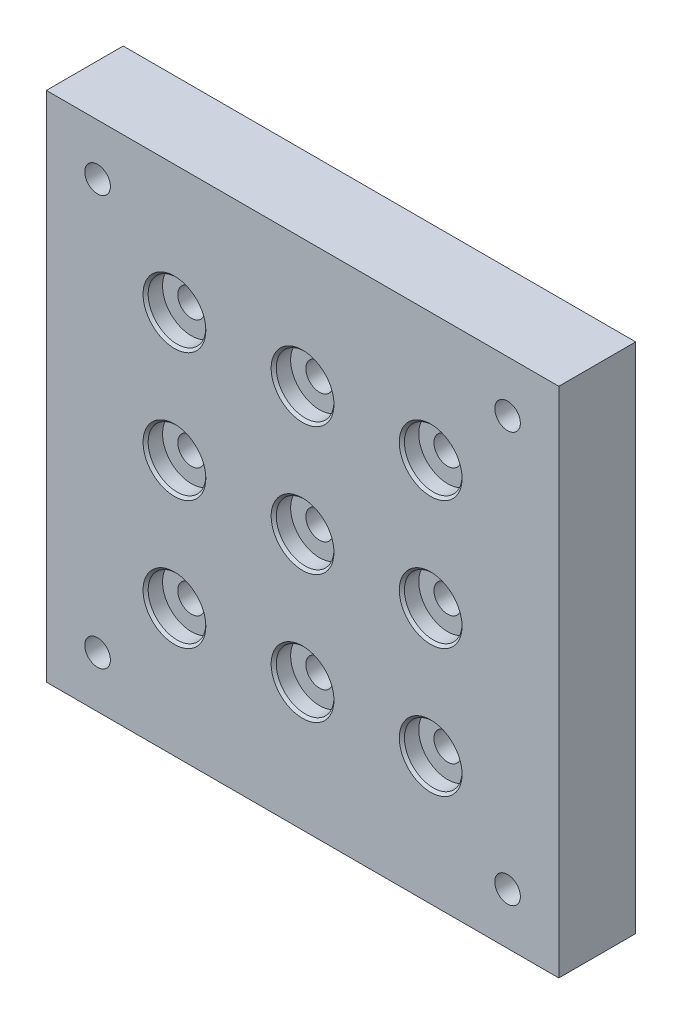
ISO-10303-21;
HEADER;
FILE_DESCRIPTION(('STEP AP214'),'2;1');
FILE_NAME('part.step','',(''),(''),'','','');
FILE_SCHEMA(('AUTOMOTIVE_DESIGN { 1 0 10303 214 1 1 1 1 }'));
ENDSEC;
DATA;
#1=APPLICATION_CONTEXT('core data for automotive mechanical design processes');
#2=APPLICATION_PROTOCOL_DEFINITION('international standard','automotive_design',2000,#1);
#3=PRODUCT_CONTEXT('',#1,'mechanical');
#4=PRODUCT('Part','Part','',(#3));
#5=PRODUCT_RELATED_PRODUCT_CATEGORY('part','',(#4));
#6=PRODUCT_DEFINITION_FORMATION('','',#4);
#7=PRODUCT_DEFINITION_CONTEXT('part definition',#1,'design');
#8=PRODUCT_DEFINITION('design','',#6,#7);
#9=PRODUCT_DEFINITION_SHAPE('','',#8);
#10=(LENGTH_UNIT() NAMED_UNIT(*) SI_UNIT(.MILLI.,.METRE.));
#11=(NAMED_UNIT(*) PLANE_ANGLE_UNIT() SI_UNIT($,.RADIAN.));
#12=(NAMED_UNIT(*) SI_UNIT($,.STERADIAN.) SOLID_ANGLE_UNIT());
#13=UNCERTAINTY_MEASURE_WITH_UNIT(LENGTH_MEASURE(1.E-05),#10,'distance_accuracy_value','');
#14=(GEOMETRIC_REPRESENTATION_CONTEXT(3) GLOBAL_UNCERTAINTY_ASSIGNED_CONTEXT((#13)) GLOBAL_UNIT_ASSIGNED_CONTEXT((#10,
#11,#12)) REPRESENTATION_CONTEXT('',''));
#15=CARTESIAN_POINT('',(0.,0.,0.));
#16=DIRECTION('',(0.,0.,1.));
#17=DIRECTION('',(1.,0.,0.));
#18=AXIS2_PLACEMENT_3D('',#15,#16,#17);
#19=CARTESIAN_POINT('',(0.,0.,19.05));
#20=DIRECTION('',(0.,0.,-1.));
#21=DIRECTION('',(-1.,0.,0.));
#22=AXIS2_PLACEMENT_3D('',#19,#20,#21);
#23=PLANE('',#22);
#24=CARTESIAN_POINT('',(-50.8,50.8,19.05));
#25=DIRECTION('',(0.,0.,1.));
#26=DIRECTION('',(1.,0.,0.));
#27=AXIS2_PLACEMENT_3D('',#24,#25,#26);
#28=CIRCLE('',#27,3.17499999999999);
#29=CARTESIAN_POINT('',(-47.625,50.8,19.05));
#30=VERTEX_POINT('',#29);
#31=EDGE_CURVE('E265',#30,#30,#28,.T.);
#32=ORIENTED_EDGE('',*,*,#31,.F.);
#33=EDGE_LOOP('',(#32));
#34=FACE_BOUND('',#33,.T.);
#35=CARTESIAN_POINT('',(50.8,50.8,19.05));
#36=DIRECTION('',(0.,0.,1.));
#37=DIRECTION('',(1.,0.,0.));
#38=AXIS2_PLACEMENT_3D('',#35,#36,#37);
#39=CIRCLE('',#38,3.17499999999999);
#40=CARTESIAN_POINT('',(53.975,50.8,19.05));
#41=VERTEX_POINT('',#40);
#42=EDGE_CURVE('E259',#41,#41,#39,.T.);
#43=ORIENTED_EDGE('',*,*,#42,.F.);
#44=EDGE_LOOP('',(#43));
#45=FACE_BOUND('',#44,.T.);
#46=CARTESIAN_POINT('',(50.8,-50.8,19.05));
#47=DIRECTION('',(0.,0.,1.));
#48=DIRECTION('',(1.,0.,0.));
#49=AXIS2_PLACEMENT_3D('',#46,#47,#48);
#50=CIRCLE('',#49,3.17499999999999);
#51=CARTESIAN_POINT('',(53.975,-50.8,19.05));
#52=VERTEX_POINT('',#51);
#53=EDGE_CURVE('E253',#52,#52,#50,.T.);
#54=ORIENTED_EDGE('',*,*,#53,.F.);
#55=EDGE_LOOP('',(#54));
#56=FACE_BOUND('',#55,.T.);
#57=DIRECTION('',(0.,1.,0.));
#58=VECTOR('',#57,1.);
#59=CARTESIAN_POINT('',(63.5,-63.5,19.05));
#60=LINE('',#59,#58);
#61=CARTESIAN_POINT('',(63.5,-63.5,19.05));
#62=VERTEX_POINT('',#61);
#63=CARTESIAN_POINT('',(63.5,63.5,19.05));
#64=VERTEX_POINT('',#63);
#65=EDGE_CURVE('E86',#62,#64,#60,.T.);
#66=ORIENTED_EDGE('',*,*,#65,.T.);
#67=DIRECTION('',(-1.,0.,0.));
#68=VECTOR('',#67,1.);
#69=CARTESIAN_POINT('',(-63.5,63.5,19.05));
#70=LINE('',#69,#68);
#71=CARTESIAN_POINT('',(-63.5,63.5,19.05));
#72=VERTEX_POINT('',#71);
#73=EDGE_CURVE('E81',#64,#72,#70,.T.);
#74=ORIENTED_EDGE('',*,*,#73,.T.);
#75=DIRECTION('',(0.,-1.,0.));
#76=VECTOR('',#75,1.);
#77=CARTESIAN_POINT('',(-63.5,-63.5,19.05));
#78=LINE('',#77,#76);
#79=CARTESIAN_POINT('',(-63.5,-63.5,19.05));
#80=VERTEX_POINT('',#79);
#81=EDGE_CURVE('E84',#72,#80,#78,.T.);
#82=ORIENTED_EDGE('',*,*,#81,.T.);
#83=DIRECTION('',(1.,0.,0.));
#84=VECTOR('',#83,1.);
#85=CARTESIAN_POINT('',(-63.5,-63.5,19.05));
#86=LINE('',#85,#84);
#87=EDGE_CURVE('E51',#80,#62,#86,.T.);
#88=ORIENTED_EDGE('',*,*,#87,.T.);
#89=EDGE_LOOP('',(#66,#74,#82,#88));
#90=FACE_BOUND('',#89,.T.);
#91=CARTESIAN_POINT('',(0.,0.,19.05));
#92=DIRECTION('',(0.,0.,1.));
#93=DIRECTION('',(1.,0.,0.));
#94=AXIS2_PLACEMENT_3D('',#91,#92,#93);
#95=CIRCLE('',#94,7.77875);
#96=CARTESIAN_POINT('',(7.77875,0.,19.05));
#97=VERTEX_POINT('',#96);
#98=EDGE_CURVE('E124',#97,#97,#95,.T.);
#99=ORIENTED_EDGE('',*,*,#98,.F.);
#100=EDGE_LOOP('',(#99));
#101=FACE_BOUND('',#100,.T.);
#102=CARTESIAN_POINT('',(-31.75,0.,19.05));
#103=DIRECTION('',(0.,0.,1.));
#104=DIRECTION('',(1.,0.,0.));
#105=AXIS2_PLACEMENT_3D('',#102,#103,#104);
#106=CIRCLE('',#105,7.77875);
#107=CARTESIAN_POINT('',(-23.97125,0.,19.05));
#108=VERTEX_POINT('',#107);
#109=EDGE_CURVE('E139',#108,#108,#106,.T.);
#110=ORIENTED_EDGE('',*,*,#109,.F.);
#111=EDGE_LOOP('',(#110));
#112=FACE_BOUND('',#111,.T.);
#113=CARTESIAN_POINT('',(31.75,0.,19.05));
#114=DIRECTION('',(0.,0.,1.));
#115=DIRECTION('',(1.,0.,0.));
#116=AXIS2_PLACEMENT_3D('',#113,#114,#115);
#117=CIRCLE('',#116,7.77875);
#118=CARTESIAN_POINT('',(39.52875,0.,19.05));
#119=VERTEX_POINT('',#118);
#120=EDGE_CURVE('E154',#119,#119,#117,.T.);
#121=ORIENTED_EDGE('',*,*,#120,.F.);
#122=EDGE_LOOP('',(#121));
#123=FACE_BOUND('',#122,.T.);
#124=CARTESIAN_POINT('',(0.,31.75,19.05));
#125=DIRECTION('',(0.,0.,1.));
#126=DIRECTION('',(1.,0.,0.));
#127=AXIS2_PLACEMENT_3D('',#124,#125,#126);
#128=CIRCLE('',#127,7.77875);
#129=CARTESIAN_POINT('',(7.77875,31.75,19.05));
#130=VERTEX_POINT('',#129);
#131=EDGE_CURVE('E169',#130,#130,#128,.T.);
#132=ORIENTED_EDGE('',*,*,#131,.F.);
#133=EDGE_LOOP('',(#132));
#134=FACE_BOUND('',#133,.T.);
#135=CARTESIAN_POINT('',(-31.75,31.75,19.05));
#136=DIRECTION('',(0.,0.,1.));
#137=DIRECTION('',(1.,0.,0.));
#138=AXIS2_PLACEMENT_3D('',#135,#136,#137);
#139=CIRCLE('',#138,7.77875);
#140=CARTESIAN_POINT('',(-23.97125,31.75,19.05));
#141=VERTEX_POINT('',#140);
#142=EDGE_CURVE('E184',#141,#141,#139,.T.);
#143=ORIENTED_EDGE('',*,*,#142,.F.);
#144=EDGE_LOOP('',(#143));
#145=FACE_BOUND('',#144,.T.);
#146=CARTESIAN_POINT('',(31.75,31.75,19.05));
#147=DIRECTION('',(0.,0.,1.));
#148=DIRECTION('',(1.,0.,0.));
#149=AXIS2_PLACEMENT_3D('',#146,#147,#148);
#150=CIRCLE('',#149,7.77875);
#151=CARTESIAN_POINT('',(39.52875,31.75,19.05));
#152=VERTEX_POINT('',#151);
#153=EDGE_CURVE('E199',#152,#152,#150,.T.);
#154=ORIENTED_EDGE('',*,*,#153,.F.);
#155=EDGE_LOOP('',(#154));
#156=FACE_BOUND('',#155,.T.);
#157=CARTESIAN_POINT('',(0.,-31.75,19.05));
#158=DIRECTION('',(0.,0.,1.));
#159=DIRECTION('',(1.,0.,0.));
#160=AXIS2_PLACEMENT_3D('',#157,#158,#159);
#161=CIRCLE('',#160,7.77875);
#162=CARTESIAN_POINT('',(7.77875,-31.75,19.05));
#163=VERTEX_POINT('',#162);
#164=EDGE_CURVE('E214',#163,#163,#161,.T.);
#165=ORIENTED_EDGE('',*,*,#164,.F.);
#166=EDGE_LOOP('',(#165));
#167=FACE_BOUND('',#166,.T.);
#168=CARTESIAN_POINT('',(-31.75,-31.75,19.05));
#169=DIRECTION('',(0.,0.,1.));
#170=DIRECTION('',(1.,0.,0.));
#171=AXIS2_PLACEMENT_3D('',#168,#169,#170);
#172=CIRCLE('',#171,7.77875);
#173=CARTESIAN_POINT('',(-23.97125,-31.75,19.05));
#174=VERTEX_POINT('',#173);
#175=EDGE_CURVE('E229',#174,#174,#172,.T.);
#176=ORIENTED_EDGE('',*,*,#175,.F.);
#177=EDGE_LOOP('',(#176));
#178=FACE_BOUND('',#177,.T.);
#179=CARTESIAN_POINT('',(31.75,-31.75,19.05));
#180=DIRECTION('',(0.,0.,1.));
#181=DIRECTION('',(1.,0.,0.));
#182=AXIS2_PLACEMENT_3D('',#179,#180,#181);
#183=CIRCLE('',#182,7.77875);
#184=CARTESIAN_POINT('',(39.52875,-31.75,19.05));
#185=VERTEX_POINT('',#184);
#186=EDGE_CURVE('E244',#185,#185,#183,.T.);
#187=ORIENTED_EDGE('',*,*,#186,.F.);
#188=EDGE_LOOP('',(#187));
#189=FACE_BOUND('',#188,.T.);
#190=CARTESIAN_POINT('',(-50.8,-50.8,19.05));
#191=DIRECTION('',(0.,0.,1.));
#192=DIRECTION('',(1.,0.,0.));
#193=AXIS2_PLACEMENT_3D('',#190,#191,#192);
#194=CIRCLE('',#193,3.17499999999999);
#195=CARTESIAN_POINT('',(-47.625,-50.8,19.05));
#196=VERTEX_POINT('',#195);
#197=EDGE_CURVE('E250',#196,#196,#194,.T.);
#198=ORIENTED_EDGE('',*,*,#197,.F.);
#199=EDGE_LOOP('',(#198));
#200=FACE_BOUND('',#199,.T.);
#201=ADVANCED_FACE('F33',(#34,#45,#56,#90,#101,#112,#123,#134,#145,#156,#167,#178,#189,#200),
#23,.F.);
#202=CARTESIAN_POINT('',(63.5,-63.5,19.05));
#203=DIRECTION('',(-1.,0.,0.));
#204=DIRECTION('',(0.,0.,1.));
#205=AXIS2_PLACEMENT_3D('',#202,#203,#204);
#206=PLANE('',#205);
#207=DIRECTION('',(0.,1.,0.));
#208=VECTOR('',#207,1.);
#209=CARTESIAN_POINT('',(63.5,-63.5,0.));
#210=LINE('',#209,#208);
#211=CARTESIAN_POINT('',(63.5,-63.5,0.));
#212=VERTEX_POINT('',#211);
#213=CARTESIAN_POINT('',(63.5,63.5,0.));
#214=VERTEX_POINT('',#213);
#215=EDGE_CURVE('E99',#212,#214,#210,.T.);
#216=ORIENTED_EDGE('',*,*,#215,.T.);
#217=DIRECTION('',(0.,0.,-1.));
#218=VECTOR('',#217,1.);
#219=CARTESIAN_POINT('',(63.5,63.5,19.05));
#220=LINE('',#219,#218);
#221=EDGE_CURVE('E11',#64,#214,#220,.T.);
#222=ORIENTED_EDGE('',*,*,#221,.F.);
#223=ORIENTED_EDGE('',*,*,#65,.F.);
#224=DIRECTION('',(0.,0.,-1.));
#225=VECTOR('',#224,1.);
#226=CARTESIAN_POINT('',(63.5,-63.5,19.05));
#227=LINE('',#226,#225);
#228=EDGE_CURVE('E95',#62,#212,#227,.T.);
#229=ORIENTED_EDGE('',*,*,#228,.T.);
#230=EDGE_LOOP('',(#216,#222,#223,#229));
#231=FACE_BOUND('',#230,.T.);
#232=ADVANCED_FACE('F35',(#231),#206,.F.);
#233=CARTESIAN_POINT('',(-63.5,63.5,19.05));
#234=DIRECTION('',(0.,-1.,0.));
#235=DIRECTION('',(0.,0.,-1.));
#236=AXIS2_PLACEMENT_3D('',#233,#234,#235);
#237=PLANE('',#236);
#238=DIRECTION('',(-1.,0.,0.));
#239=VECTOR('',#238,1.);
#240=CARTESIAN_POINT('',(-63.5,63.5,0.));
#241=LINE('',#240,#239);
#242=CARTESIAN_POINT('',(-63.5,63.5,0.));
#243=VERTEX_POINT('',#242);
#244=EDGE_CURVE('E90',#214,#243,#241,.T.);
#245=ORIENTED_EDGE('',*,*,#244,.T.);
#246=DIRECTION('',(0.,0.,-1.));
#247=VECTOR('',#246,1.);
#248=CARTESIAN_POINT('',(-63.5,63.5,19.05));
#249=LINE('',#248,#247);
#250=EDGE_CURVE('E43',#72,#243,#249,.T.);
#251=ORIENTED_EDGE('',*,*,#250,.F.);
#252=ORIENTED_EDGE('',*,*,#73,.F.);
#253=ORIENTED_EDGE('',*,*,#221,.T.);
#254=EDGE_LOOP('',(#245,#251,#252,#253));
#255=FACE_BOUND('',#254,.T.);
#256=ADVANCED_FACE('F89',(#255),#237,.F.);
#257=CARTESIAN_POINT('',(-63.5,-63.5,19.05));
#258=DIRECTION('',(1.,0.,0.));
#259=DIRECTION('',(0.,0.,-1.));
#260=AXIS2_PLACEMENT_3D('',#257,#258,#259);
#261=PLANE('',#260);
#262=DIRECTION('',(0.,-1.,0.));
#263=VECTOR('',#262,1.);
#264=CARTESIAN_POINT('',(-63.5,-63.5,0.));
#265=LINE('',#264,#263);
#266=CARTESIAN_POINT('',(-63.5,-63.5,0.));
#267=VERTEX_POINT('',#266);
#268=EDGE_CURVE('E68',#243,#267,#265,.T.);
#269=ORIENTED_EDGE('',*,*,#268,.T.);
#270=DIRECTION('',(0.,0.,-1.));
#271=VECTOR('',#270,1.);
#272=CARTESIAN_POINT('',(-63.5,-63.5,19.05));
#273=LINE('',#272,#271);
#274=EDGE_CURVE('E91',#80,#267,#273,.T.);
#275=ORIENTED_EDGE('',*,*,#274,.F.);
#276=ORIENTED_EDGE('',*,*,#81,.F.);
#277=ORIENTED_EDGE('',*,*,#250,.T.);
#278=EDGE_LOOP('',(#269,#275,#276,#277));
#279=FACE_BOUND('',#278,.T.);
#280=ADVANCED_FACE('F93',(#279),#261,.F.);
#281=CARTESIAN_POINT('',(-63.5,-63.5,19.05));
#282=DIRECTION('',(0.,1.,0.));
#283=DIRECTION('',(0.,0.,1.));
#284=AXIS2_PLACEMENT_3D('',#281,#282,#283);
#285=PLANE('',#284);
#286=DIRECTION('',(1.,0.,0.));
#287=VECTOR('',#286,1.);
#288=CARTESIAN_POINT('',(-63.5,-63.5,0.));
#289=LINE('',#288,#287);
#290=EDGE_CURVE('E74',#267,#212,#289,.T.);
#291=ORIENTED_EDGE('',*,*,#290,.T.);
#292=ORIENTED_EDGE('',*,*,#228,.F.);
#293=ORIENTED_EDGE('',*,*,#87,.F.);
#294=ORIENTED_EDGE('',*,*,#274,.T.);
#295=EDGE_LOOP('',(#291,#292,#293,#294));
#296=FACE_BOUND('',#295,.T.);
#297=ADVANCED_FACE('F107',(#296),#285,.F.);
#298=CARTESIAN_POINT('',(0.,0.,0.));
#299=DIRECTION('',(0.,0.,-1.));
#300=DIRECTION('',(-1.,0.,0.));
#301=AXIS2_PLACEMENT_3D('',#298,#299,#300);
#302=PLANE('',#301);
#303=CARTESIAN_POINT('',(-50.8,50.8,0.));
#304=DIRECTION('',(0.,0.,-1.));
#305=DIRECTION('',(-1.,0.,0.));
#306=AXIS2_PLACEMENT_3D('',#303,#304,#305);
#307=CIRCLE('',#306,3.17499999999999);
#308=CARTESIAN_POINT('',(-53.975,50.8,0.));
#309=VERTEX_POINT('',#308);
#310=EDGE_CURVE('E262',#309,#309,#307,.T.);
#311=ORIENTED_EDGE('',*,*,#310,.F.);
#312=EDGE_LOOP('',(#311));
#313=FACE_BOUND('',#312,.T.);
#314=CARTESIAN_POINT('',(50.8,50.8,0.));
#315=DIRECTION('',(0.,0.,-1.));
#316=DIRECTION('',(-1.,0.,0.));
#317=AXIS2_PLACEMENT_3D('',#314,#315,#316);
#318=CIRCLE('',#317,3.17499999999999);
#319=CARTESIAN_POINT('',(47.625,50.8,0.));
#320=VERTEX_POINT('',#319);
#321=EDGE_CURVE('E256',#320,#320,#318,.T.);
#322=ORIENTED_EDGE('',*,*,#321,.F.);
#323=EDGE_LOOP('',(#322));
#324=FACE_BOUND('',#323,.T.);
#325=CARTESIAN_POINT('',(50.8,-50.8,0.));
#326=DIRECTION('',(0.,0.,-1.));
#327=DIRECTION('',(-1.,0.,0.));
#328=AXIS2_PLACEMENT_3D('',#325,#326,#327);
#329=CIRCLE('',#328,3.17499999999999);
#330=CARTESIAN_POINT('',(47.625,-50.8,0.));
#331=VERTEX_POINT('',#330);
#332=EDGE_CURVE('E37',#331,#331,#329,.T.);
#333=ORIENTED_EDGE('',*,*,#332,.F.);
#334=EDGE_LOOP('',(#333));
#335=FACE_BOUND('',#334,.T.);
#336=CARTESIAN_POINT('',(-50.8,-50.8,0.));
#337=DIRECTION('',(0.,0.,-1.));
#338=DIRECTION('',(-1.,0.,0.));
#339=AXIS2_PLACEMENT_3D('',#336,#337,#338);
#340=CIRCLE('',#339,3.17499999999999);
#341=CARTESIAN_POINT('',(-53.975,-50.8,0.));
#342=VERTEX_POINT('',#341);
#343=EDGE_CURVE('E247',#342,#342,#340,.T.);
#344=ORIENTED_EDGE('',*,*,#343,.F.);
#345=EDGE_LOOP('',(#344));
#346=FACE_BOUND('',#345,.T.);
#347=CARTESIAN_POINT('',(31.75,-31.75,0.));
#348=DIRECTION('',(0.,0.,1.));
#349=DIRECTION('',(1.,0.,0.));
#350=AXIS2_PLACEMENT_3D('',#347,#348,#349);
#351=CIRCLE('',#350,3.3782);
#352=CARTESIAN_POINT('',(35.1282,-31.75,0.));
#353=VERTEX_POINT('',#352);
#354=EDGE_CURVE('E232',#353,#353,#351,.T.);
#355=ORIENTED_EDGE('',*,*,#354,.T.);
#356=EDGE_LOOP('',(#355));
#357=FACE_BOUND('',#356,.T.);
#358=CARTESIAN_POINT('',(-31.75,-31.75,0.));
#359=DIRECTION('',(0.,0.,1.));
#360=DIRECTION('',(1.,0.,0.));
#361=AXIS2_PLACEMENT_3D('',#358,#359,#360);
#362=CIRCLE('',#361,3.3782);
#363=CARTESIAN_POINT('',(-28.3718,-31.75,0.));
#364=VERTEX_POINT('',#363);
#365=EDGE_CURVE('E217',#364,#364,#362,.T.);
#366=ORIENTED_EDGE('',*,*,#365,.T.);
#367=EDGE_LOOP('',(#366));
#368=FACE_BOUND('',#367,.T.);
#369=CARTESIAN_POINT('',(0.,-31.75,0.));
#370=DIRECTION('',(0.,0.,1.));
#371=DIRECTION('',(1.,0.,0.));
#372=AXIS2_PLACEMENT_3D('',#369,#370,#371);
#373=CIRCLE('',#372,3.3782);
#374=CARTESIAN_POINT('',(3.3782,-31.75,0.));
#375=VERTEX_POINT('',#374);
#376=EDGE_CURVE('E202',#375,#375,#373,.T.);
#377=ORIENTED_EDGE('',*,*,#376,.T.);
#378=EDGE_LOOP('',(#377));
#379=FACE_BOUND('',#378,.T.);
#380=CARTESIAN_POINT('',(31.75,31.75,0.));
#381=DIRECTION('',(0.,0.,1.));
#382=DIRECTION('',(1.,0.,0.));
#383=AXIS2_PLACEMENT_3D('',#380,#381,#382);
#384=CIRCLE('',#383,3.3782);
#385=CARTESIAN_POINT('',(35.1282,31.75,0.));
#386=VERTEX_POINT('',#385);
#387=EDGE_CURVE('E187',#386,#386,#384,.T.);
#388=ORIENTED_EDGE('',*,*,#387,.T.);
#389=EDGE_LOOP('',(#388));
#390=FACE_BOUND('',#389,.T.);
#391=CARTESIAN_POINT('',(-31.75,31.75,0.));
#392=DIRECTION('',(0.,0.,1.));
#393=DIRECTION('',(1.,0.,0.));
#394=AXIS2_PLACEMENT_3D('',#391,#392,#393);
#395=CIRCLE('',#394,3.3782);
#396=CARTESIAN_POINT('',(-28.3718,31.75,0.));
#397=VERTEX_POINT('',#396);
#398=EDGE_CURVE('E172',#397,#397,#395,.T.);
#399=ORIENTED_EDGE('',*,*,#398,.T.);
#400=EDGE_LOOP('',(#399));
#401=FACE_BOUND('',#400,.T.);
#402=CARTESIAN_POINT('',(0.,31.75,0.));
#403=DIRECTION('',(0.,0.,1.));
#404=DIRECTION('',(1.,0.,0.));
#405=AXIS2_PLACEMENT_3D('',#402,#403,#404);
#406=CIRCLE('',#405,3.3782);
#407=CARTESIAN_POINT('',(3.3782,31.75,0.));
#408=VERTEX_POINT('',#407);
#409=EDGE_CURVE('E157',#408,#408,#406,.T.);
#410=ORIENTED_EDGE('',*,*,#409,.T.);
#411=EDGE_LOOP('',(#410));
#412=FACE_BOUND('',#411,.T.);
#413=CARTESIAN_POINT('',(31.75,0.,0.));
#414=DIRECTION('',(0.,0.,1.));
#415=DIRECTION('',(1.,0.,0.));
#416=AXIS2_PLACEMENT_3D('',#413,#414,#415);
#417=CIRCLE('',#416,3.3782);
#418=CARTESIAN_POINT('',(35.1282,0.,0.));
#419=VERTEX_POINT('',#418);
#420=EDGE_CURVE('E142',#419,#419,#417,.T.);
#421=ORIENTED_EDGE('',*,*,#420,.T.);
#422=EDGE_LOOP('',(#421));
#423=FACE_BOUND('',#422,.T.);
#424=CARTESIAN_POINT('',(-31.75,0.,0.));
#425=DIRECTION('',(0.,0.,1.));
#426=DIRECTION('',(1.,0.,0.));
#427=AXIS2_PLACEMENT_3D('',#424,#425,#426);
#428=CIRCLE('',#427,3.3782);
#429=CARTESIAN_POINT('',(-28.3718,0.,0.));
#430=VERTEX_POINT('',#429);
#431=EDGE_CURVE('E127',#430,#430,#428,.T.);
#432=ORIENTED_EDGE('',*,*,#431,.T.);
#433=EDGE_LOOP('',(#432));
#434=FACE_BOUND('',#433,.T.);
#435=CARTESIAN_POINT('',(0.,0.,0.));
#436=DIRECTION('',(0.,0.,1.));
#437=DIRECTION('',(1.,0.,0.));
#438=AXIS2_PLACEMENT_3D('',#435,#436,#437);
#439=CIRCLE('',#438,3.3782);
#440=CARTESIAN_POINT('',(3.3782,0.,0.));
#441=VERTEX_POINT('',#440);
#442=EDGE_CURVE('E102',#441,#441,#439,.T.);
#443=ORIENTED_EDGE('',*,*,#442,.T.);
#444=EDGE_LOOP('',(#443));
#445=FACE_BOUND('',#444,.T.);
#446=ORIENTED_EDGE('',*,*,#215,.F.);
#447=ORIENTED_EDGE('',*,*,#290,.F.);
#448=ORIENTED_EDGE('',*,*,#268,.F.);
#449=ORIENTED_EDGE('',*,*,#244,.F.);
#450=EDGE_LOOP('',(#446,#447,#448,#449));
#451=FACE_BOUND('',#450,.T.);
#452=ADVANCED_FACE('F110',(#313,#324,#335,#346,#357,#368,#379,#390,#401,#412,#423,#434,#445,
#451),#302,.T.);
#453=CARTESIAN_POINT('',(0.,0.,19.05));
#454=DIRECTION('',(0.,0.,1.));
#455=DIRECTION('',(1.,0.,0.));
#456=AXIS2_PLACEMENT_3D('',#453,#454,#455);
#457=CYLINDRICAL_SURFACE('',#456,3.3782);
#458=ORIENTED_EDGE('',*,*,#442,.F.);
#459=EDGE_LOOP('',(#458));
#460=FACE_BOUND('',#459,.T.);
#461=CARTESIAN_POINT('',(0.,0.,14.859));
#462=DIRECTION('',(0.,0.,1.));
#463=DIRECTION('',(1.,0.,0.));
#464=AXIS2_PLACEMENT_3D('',#461,#462,#463);
#465=CIRCLE('',#464,3.3782);
#466=CARTESIAN_POINT('',(3.3782,0.,14.859));
#467=VERTEX_POINT('',#466);
#468=EDGE_CURVE('E115',#467,#467,#465,.T.);
#469=ORIENTED_EDGE('',*,*,#468,.T.);
#470=EDGE_LOOP('',(#469));
#471=FACE_BOUND('',#470,.T.);
#472=ADVANCED_FACE('F434',(#460,#471),#457,.F.);
#473=CARTESIAN_POINT('',(7.14375,0.,14.859));
#474=DIRECTION('',(0.,0.,-1.));
#475=DIRECTION('',(-1.,0.,0.));
#476=AXIS2_PLACEMENT_3D('',#473,#474,#475);
#477=PLANE('',#476);
#478=ORIENTED_EDGE('',*,*,#468,.F.);
#479=EDGE_LOOP('',(#478));
#480=FACE_BOUND('',#479,.T.);
#481=CARTESIAN_POINT('',(0.,0.,14.859));
#482=DIRECTION('',(0.,0.,1.));
#483=DIRECTION('',(1.,0.,0.));
#484=AXIS2_PLACEMENT_3D('',#481,#482,#483);
#485=CIRCLE('',#484,7.14375);
#486=CARTESIAN_POINT('',(7.14375,0.,14.859));
#487=VERTEX_POINT('',#486);
#488=EDGE_CURVE('E118',#487,#487,#485,.T.);
#489=ORIENTED_EDGE('',*,*,#488,.T.);
#490=EDGE_LOOP('',(#489));
#491=FACE_BOUND('',#490,.T.);
#492=ADVANCED_FACE('F430',(#480,#491),#477,.F.);
#493=CARTESIAN_POINT('',(0.,0.,19.05));
#494=DIRECTION('',(0.,0.,1.));
#495=DIRECTION('',(1.,0.,0.));
#496=AXIS2_PLACEMENT_3D('',#493,#494,#495);
#497=CYLINDRICAL_SURFACE('',#496,7.14375);
#498=ORIENTED_EDGE('',*,*,#488,.F.);
#499=EDGE_LOOP('',(#498));
#500=FACE_BOUND('',#499,.T.);
#501=CARTESIAN_POINT('',(0.,0.,18.415));
#502=DIRECTION('',(0.,0.,1.));
#503=DIRECTION('',(1.,0.,0.));
#504=AXIS2_PLACEMENT_3D('',#501,#502,#503);
#505=CIRCLE('',#504,7.14375);
#506=CARTESIAN_POINT('',(7.14375,0.,18.415));
#507=VERTEX_POINT('',#506);
#508=EDGE_CURVE('E121',#507,#507,#505,.T.);
#509=ORIENTED_EDGE('',*,*,#508,.T.);
#510=EDGE_LOOP('',(#509));
#511=FACE_BOUND('',#510,.T.);
#512=ADVANCED_FACE('F426',(#500,#511),#497,.F.);
#513=CARTESIAN_POINT('',(0.,0.,19.05));
#514=DIRECTION('',(0.,0.,1.));
#515=DIRECTION('',(1.,0.,0.));
#516=AXIS2_PLACEMENT_3D('',#513,#514,#515);
#517=CONICAL_SURFACE('',#516,7.77875,0.78539816339745);
#518=ORIENTED_EDGE('',*,*,#508,.F.);
#519=EDGE_LOOP('',(#518));
#520=FACE_BOUND('',#519,.T.);
#521=ORIENTED_EDGE('',*,*,#98,.T.);
#522=EDGE_LOOP('',(#521));
#523=FACE_BOUND('',#522,.T.);
#524=ADVANCED_FACE('F422',(#520,#523),#517,.F.);
#525=CARTESIAN_POINT('',(-31.75,0.,19.05));
#526=DIRECTION('',(0.,0.,1.));
#527=DIRECTION('',(1.,0.,0.));
#528=AXIS2_PLACEMENT_3D('',#525,#526,#527);
#529=CYLINDRICAL_SURFACE('',#528,3.3782);
#530=ORIENTED_EDGE('',*,*,#431,.F.);
#531=EDGE_LOOP('',(#530));
#532=FACE_BOUND('',#531,.T.);
#533=CARTESIAN_POINT('',(-31.75,0.,14.859));
#534=DIRECTION('',(0.,0.,1.));
#535=DIRECTION('',(1.,0.,0.));
#536=AXIS2_PLACEMENT_3D('',#533,#534,#535);
#537=CIRCLE('',#536,3.3782);
#538=CARTESIAN_POINT('',(-28.3718,0.,14.859));
#539=VERTEX_POINT('',#538);
#540=EDGE_CURVE('E130',#539,#539,#537,.T.);
#541=ORIENTED_EDGE('',*,*,#540,.T.);
#542=EDGE_LOOP('',(#541));
#543=FACE_BOUND('',#542,.T.);
#544=ADVANCED_FACE('F418',(#532,#543),#529,.F.);
#545=CARTESIAN_POINT('',(-24.60625,0.,14.859));
#546=DIRECTION('',(0.,0.,-1.));
#547=DIRECTION('',(-1.,0.,0.));
#548=AXIS2_PLACEMENT_3D('',#545,#546,#547);
#549=PLANE('',#548);
#550=ORIENTED_EDGE('',*,*,#540,.F.);
#551=EDGE_LOOP('',(#550));
#552=FACE_BOUND('',#551,.T.);
#553=CARTESIAN_POINT('',(-31.75,0.,14.859));
#554=DIRECTION('',(0.,0.,1.));
#555=DIRECTION('',(1.,0.,0.));
#556=AXIS2_PLACEMENT_3D('',#553,#554,#555);
#557=CIRCLE('',#556,7.14375);
#558=CARTESIAN_POINT('',(-24.60625,0.,14.859));
#559=VERTEX_POINT('',#558);
#560=EDGE_CURVE('E133',#559,#559,#557,.T.);
#561=ORIENTED_EDGE('',*,*,#560,.T.);
#562=EDGE_LOOP('',(#561));
#563=FACE_BOUND('',#562,.T.);
#564=ADVANCED_FACE('F414',(#552,#563),#549,.F.);
#565=CARTESIAN_POINT('',(-31.75,0.,19.05));
#566=DIRECTION('',(0.,0.,1.));
#567=DIRECTION('',(1.,0.,0.));
#568=AXIS2_PLACEMENT_3D('',#565,#566,#567);
#569=CYLINDRICAL_SURFACE('',#568,7.14375);
#570=ORIENTED_EDGE('',*,*,#560,.F.);
#571=EDGE_LOOP('',(#570));
#572=FACE_BOUND('',#571,.T.);
#573=CARTESIAN_POINT('',(-31.75,0.,18.415));
#574=DIRECTION('',(0.,0.,1.));
#575=DIRECTION('',(1.,0.,0.));
#576=AXIS2_PLACEMENT_3D('',#573,#574,#575);
#577=CIRCLE('',#576,7.14375);
#578=CARTESIAN_POINT('',(-24.60625,0.,18.415));
#579=VERTEX_POINT('',#578);
#580=EDGE_CURVE('E136',#579,#579,#577,.T.);
#581=ORIENTED_EDGE('',*,*,#580,.T.);
#582=EDGE_LOOP('',(#581));
#583=FACE_BOUND('',#582,.T.);
#584=ADVANCED_FACE('F410',(#572,#583),#569,.F.);
#585=CARTESIAN_POINT('',(-31.75,0.,19.05));
#586=DIRECTION('',(0.,0.,1.));
#587=DIRECTION('',(1.,0.,0.));
#588=AXIS2_PLACEMENT_3D('',#585,#586,#587);
#589=CONICAL_SURFACE('',#588,7.77875,0.785398163397451);
#590=ORIENTED_EDGE('',*,*,#580,.F.);
#591=EDGE_LOOP('',(#590));
#592=FACE_BOUND('',#591,.T.);
#593=ORIENTED_EDGE('',*,*,#109,.T.);
#594=EDGE_LOOP('',(#593));
#595=FACE_BOUND('',#594,.T.);
#596=ADVANCED_FACE('F406',(#592,#595),#589,.F.);
#597=CARTESIAN_POINT('',(31.75,0.,19.05));
#598=DIRECTION('',(0.,0.,1.));
#599=DIRECTION('',(1.,0.,0.));
#600=AXIS2_PLACEMENT_3D('',#597,#598,#599);
#601=CYLINDRICAL_SURFACE('',#600,3.3782);
#602=ORIENTED_EDGE('',*,*,#420,.F.);
#603=EDGE_LOOP('',(#602));
#604=FACE_BOUND('',#603,.T.);
#605=CARTESIAN_POINT('',(31.75,0.,14.859));
#606=DIRECTION('',(0.,0.,1.));
#607=DIRECTION('',(1.,0.,0.));
#608=AXIS2_PLACEMENT_3D('',#605,#606,#607);
#609=CIRCLE('',#608,3.3782);
#610=CARTESIAN_POINT('',(35.1282,0.,14.859));
#611=VERTEX_POINT('',#610);
#612=EDGE_CURVE('E145',#611,#611,#609,.T.);
#613=ORIENTED_EDGE('',*,*,#612,.T.);
#614=EDGE_LOOP('',(#613));
#615=FACE_BOUND('',#614,.T.);
#616=ADVANCED_FACE('F402',(#604,#615),#601,.F.);
#617=CARTESIAN_POINT('',(38.89375,0.,14.859));
#618=DIRECTION('',(0.,0.,-1.));
#619=DIRECTION('',(-1.,0.,0.));
#620=AXIS2_PLACEMENT_3D('',#617,#618,#619);
#621=PLANE('',#620);
#622=ORIENTED_EDGE('',*,*,#612,.F.);
#623=EDGE_LOOP('',(#622));
#624=FACE_BOUND('',#623,.T.);
#625=CARTESIAN_POINT('',(31.75,0.,14.859));
#626=DIRECTION('',(0.,0.,1.));
#627=DIRECTION('',(1.,0.,0.));
#628=AXIS2_PLACEMENT_3D('',#625,#626,#627);
#629=CIRCLE('',#628,7.14375);
#630=CARTESIAN_POINT('',(38.89375,0.,14.859));
#631=VERTEX_POINT('',#630);
#632=EDGE_CURVE('E148',#631,#631,#629,.T.);
#633=ORIENTED_EDGE('',*,*,#632,.T.);
#634=EDGE_LOOP('',(#633));
#635=FACE_BOUND('',#634,.T.);
#636=ADVANCED_FACE('F398',(#624,#635),#621,.F.);
#637=CARTESIAN_POINT('',(31.75,0.,19.05));
#638=DIRECTION('',(0.,0.,1.));
#639=DIRECTION('',(1.,0.,0.));
#640=AXIS2_PLACEMENT_3D('',#637,#638,#639);
#641=CYLINDRICAL_SURFACE('',#640,7.14375);
#642=ORIENTED_EDGE('',*,*,#632,.F.);
#643=EDGE_LOOP('',(#642));
#644=FACE_BOUND('',#643,.T.);
#645=CARTESIAN_POINT('',(31.75,0.,18.415));
#646=DIRECTION('',(0.,0.,1.));
#647=DIRECTION('',(1.,0.,0.));
#648=AXIS2_PLACEMENT_3D('',#645,#646,#647);
#649=CIRCLE('',#648,7.14375);
#650=CARTESIAN_POINT('',(38.89375,0.,18.415));
#651=VERTEX_POINT('',#650);
#652=EDGE_CURVE('E151',#651,#651,#649,.T.);
#653=ORIENTED_EDGE('',*,*,#652,.T.);
#654=EDGE_LOOP('',(#653));
#655=FACE_BOUND('',#654,.T.);
#656=ADVANCED_FACE('F394',(#644,#655),#641,.F.);
#657=CARTESIAN_POINT('',(31.75,0.,19.05));
#658=DIRECTION('',(0.,0.,1.));
#659=DIRECTION('',(1.,0.,0.));
#660=AXIS2_PLACEMENT_3D('',#657,#658,#659);
#661=CONICAL_SURFACE('',#660,7.77875,0.785398163397451);
#662=ORIENTED_EDGE('',*,*,#652,.F.);
#663=EDGE_LOOP('',(#662));
#664=FACE_BOUND('',#663,.T.);
#665=ORIENTED_EDGE('',*,*,#120,.T.);
#666=EDGE_LOOP('',(#665));
#667=FACE_BOUND('',#666,.T.);
#668=ADVANCED_FACE('F390',(#664,#667),#661,.F.);
#669=CARTESIAN_POINT('',(0.,31.75,19.05));
#670=DIRECTION('',(0.,0.,1.));
#671=DIRECTION('',(1.,0.,0.));
#672=AXIS2_PLACEMENT_3D('',#669,#670,#671);
#673=CYLINDRICAL_SURFACE('',#672,3.3782);
#674=ORIENTED_EDGE('',*,*,#409,.F.);
#675=EDGE_LOOP('',(#674));
#676=FACE_BOUND('',#675,.T.);
#677=CARTESIAN_POINT('',(0.,31.75,14.859));
#678=DIRECTION('',(0.,0.,1.));
#679=DIRECTION('',(1.,0.,0.));
#680=AXIS2_PLACEMENT_3D('',#677,#678,#679);
#681=CIRCLE('',#680,3.3782);
#682=CARTESIAN_POINT('',(3.3782,31.75,14.859));
#683=VERTEX_POINT('',#682);
#684=EDGE_CURVE('E160',#683,#683,#681,.T.);
#685=ORIENTED_EDGE('',*,*,#684,.T.);
#686=EDGE_LOOP('',(#685));
#687=FACE_BOUND('',#686,.T.);
#688=ADVANCED_FACE('F386',(#676,#687),#673,.F.);
#689=CARTESIAN_POINT('',(7.14375,31.75,14.859));
#690=DIRECTION('',(0.,0.,-1.));
#691=DIRECTION('',(-1.,0.,0.));
#692=AXIS2_PLACEMENT_3D('',#689,#690,#691);
#693=PLANE('',#692);
#694=ORIENTED_EDGE('',*,*,#684,.F.);
#695=EDGE_LOOP('',(#694));
#696=FACE_BOUND('',#695,.T.);
#697=CARTESIAN_POINT('',(0.,31.75,14.859));
#698=DIRECTION('',(0.,0.,1.));
#699=DIRECTION('',(1.,0.,0.));
#700=AXIS2_PLACEMENT_3D('',#697,#698,#699);
#701=CIRCLE('',#700,7.14375);
#702=CARTESIAN_POINT('',(7.14375,31.75,14.859));
#703=VERTEX_POINT('',#702);
#704=EDGE_CURVE('E163',#703,#703,#701,.T.);
#705=ORIENTED_EDGE('',*,*,#704,.T.);
#706=EDGE_LOOP('',(#705));
#707=FACE_BOUND('',#706,.T.);
#708=ADVANCED_FACE('F382',(#696,#707),#693,.F.);
#709=CARTESIAN_POINT('',(0.,31.75,19.05));
#710=DIRECTION('',(0.,0.,1.));
#711=DIRECTION('',(1.,0.,0.));
#712=AXIS2_PLACEMENT_3D('',#709,#710,#711);
#713=CYLINDRICAL_SURFACE('',#712,7.14375);
#714=ORIENTED_EDGE('',*,*,#704,.F.);
#715=EDGE_LOOP('',(#714));
#716=FACE_BOUND('',#715,.T.);
#717=CARTESIAN_POINT('',(0.,31.75,18.415));
#718=DIRECTION('',(0.,0.,1.));
#719=DIRECTION('',(1.,0.,0.));
#720=AXIS2_PLACEMENT_3D('',#717,#718,#719);
#721=CIRCLE('',#720,7.14375);
#722=CARTESIAN_POINT('',(7.14375,31.75,18.415));
#723=VERTEX_POINT('',#722);
#724=EDGE_CURVE('E166',#723,#723,#721,.T.);
#725=ORIENTED_EDGE('',*,*,#724,.T.);
#726=EDGE_LOOP('',(#725));
#727=FACE_BOUND('',#726,.T.);
#728=ADVANCED_FACE('F378',(#716,#727),#713,.F.);
#729=CARTESIAN_POINT('',(0.,31.75,19.05));
#730=DIRECTION('',(0.,0.,1.));
#731=DIRECTION('',(1.,0.,0.));
#732=AXIS2_PLACEMENT_3D('',#729,#730,#731);
#733=CONICAL_SURFACE('',#732,7.77875,0.78539816339745);
#734=ORIENTED_EDGE('',*,*,#724,.F.);
#735=EDGE_LOOP('',(#734));
#736=FACE_BOUND('',#735,.T.);
#737=ORIENTED_EDGE('',*,*,#131,.T.);
#738=EDGE_LOOP('',(#737));
#739=FACE_BOUND('',#738,.T.);
#740=ADVANCED_FACE('F374',(#736,#739),#733,.F.);
#741=CARTESIAN_POINT('',(-31.75,31.75,19.05));
#742=DIRECTION('',(0.,0.,1.));
#743=DIRECTION('',(1.,0.,0.));
#744=AXIS2_PLACEMENT_3D('',#741,#742,#743);
#745=CYLINDRICAL_SURFACE('',#744,3.3782);
#746=ORIENTED_EDGE('',*,*,#398,.F.);
#747=EDGE_LOOP('',(#746));
#748=FACE_BOUND('',#747,.T.);
#749=CARTESIAN_POINT('',(-31.75,31.75,14.859));
#750=DIRECTION('',(0.,0.,1.));
#751=DIRECTION('',(1.,0.,0.));
#752=AXIS2_PLACEMENT_3D('',#749,#750,#751);
#753=CIRCLE('',#752,3.3782);
#754=CARTESIAN_POINT('',(-28.3718,31.75,14.859));
#755=VERTEX_POINT('',#754);
#756=EDGE_CURVE('E175',#755,#755,#753,.T.);
#757=ORIENTED_EDGE('',*,*,#756,.T.);
#758=EDGE_LOOP('',(#757));
#759=FACE_BOUND('',#758,.T.);
#760=ADVANCED_FACE('F370',(#748,#759),#745,.F.);
#761=CARTESIAN_POINT('',(-24.60625,31.75,14.859));
#762=DIRECTION('',(0.,0.,-1.));
#763=DIRECTION('',(-1.,0.,0.));
#764=AXIS2_PLACEMENT_3D('',#761,#762,#763);
#765=PLANE('',#764);
#766=ORIENTED_EDGE('',*,*,#756,.F.);
#767=EDGE_LOOP('',(#766));
#768=FACE_BOUND('',#767,.T.);
#769=CARTESIAN_POINT('',(-31.75,31.75,14.859));
#770=DIRECTION('',(0.,0.,1.));
#771=DIRECTION('',(1.,0.,0.));
#772=AXIS2_PLACEMENT_3D('',#769,#770,#771);
#773=CIRCLE('',#772,7.14375);
#774=CARTESIAN_POINT('',(-24.60625,31.75,14.859));
#775=VERTEX_POINT('',#774);
#776=EDGE_CURVE('E178',#775,#775,#773,.T.);
#777=ORIENTED_EDGE('',*,*,#776,.T.);
#778=EDGE_LOOP('',(#777));
#779=FACE_BOUND('',#778,.T.);
#780=ADVANCED_FACE('F366',(#768,#779),#765,.F.);
#781=CARTESIAN_POINT('',(-31.75,31.75,19.05));
#782=DIRECTION('',(0.,0.,1.));
#783=DIRECTION('',(1.,0.,0.));
#784=AXIS2_PLACEMENT_3D('',#781,#782,#783);
#785=CYLINDRICAL_SURFACE('',#784,7.14375);
#786=ORIENTED_EDGE('',*,*,#776,.F.);
#787=EDGE_LOOP('',(#786));
#788=FACE_BOUND('',#787,.T.);
#789=CARTESIAN_POINT('',(-31.75,31.75,18.415));
#790=DIRECTION('',(0.,0.,1.));
#791=DIRECTION('',(1.,0.,0.));
#792=AXIS2_PLACEMENT_3D('',#789,#790,#791);
#793=CIRCLE('',#792,7.14375);
#794=CARTESIAN_POINT('',(-24.60625,31.75,18.415));
#795=VERTEX_POINT('',#794);
#796=EDGE_CURVE('E181',#795,#795,#793,.T.);
#797=ORIENTED_EDGE('',*,*,#796,.T.);
#798=EDGE_LOOP('',(#797));
#799=FACE_BOUND('',#798,.T.);
#800=ADVANCED_FACE('F362',(#788,#799),#785,.F.);
#801=CARTESIAN_POINT('',(-31.75,31.75,19.05));
#802=DIRECTION('',(0.,0.,1.));
#803=DIRECTION('',(1.,0.,0.));
#804=AXIS2_PLACEMENT_3D('',#801,#802,#803);
#805=CONICAL_SURFACE('',#804,7.77875,0.785398163397451);
#806=ORIENTED_EDGE('',*,*,#796,.F.);
#807=EDGE_LOOP('',(#806));
#808=FACE_BOUND('',#807,.T.);
#809=ORIENTED_EDGE('',*,*,#142,.T.);
#810=EDGE_LOOP('',(#809));
#811=FACE_BOUND('',#810,.T.);
#812=ADVANCED_FACE('F358',(#808,#811),#805,.F.);
#813=CARTESIAN_POINT('',(31.75,31.75,19.05));
#814=DIRECTION('',(0.,0.,1.));
#815=DIRECTION('',(1.,0.,0.));
#816=AXIS2_PLACEMENT_3D('',#813,#814,#815);
#817=CYLINDRICAL_SURFACE('',#816,3.3782);
#818=ORIENTED_EDGE('',*,*,#387,.F.);
#819=EDGE_LOOP('',(#818));
#820=FACE_BOUND('',#819,.T.);
#821=CARTESIAN_POINT('',(31.75,31.75,14.859));
#822=DIRECTION('',(0.,0.,1.));
#823=DIRECTION('',(1.,0.,0.));
#824=AXIS2_PLACEMENT_3D('',#821,#822,#823);
#825=CIRCLE('',#824,3.3782);
#826=CARTESIAN_POINT('',(35.1282,31.75,14.859));
#827=VERTEX_POINT('',#826);
#828=EDGE_CURVE('E190',#827,#827,#825,.T.);
#829=ORIENTED_EDGE('',*,*,#828,.T.);
#830=EDGE_LOOP('',(#829));
#831=FACE_BOUND('',#830,.T.);
#832=ADVANCED_FACE('F354',(#820,#831),#817,.F.);
#833=CARTESIAN_POINT('',(38.89375,31.75,14.859));
#834=DIRECTION('',(0.,0.,-1.));
#835=DIRECTION('',(-1.,0.,0.));
#836=AXIS2_PLACEMENT_3D('',#833,#834,#835);
#837=PLANE('',#836);
#838=ORIENTED_EDGE('',*,*,#828,.F.);
#839=EDGE_LOOP('',(#838));
#840=FACE_BOUND('',#839,.T.);
#841=CARTESIAN_POINT('',(31.75,31.75,14.859));
#842=DIRECTION('',(0.,0.,1.));
#843=DIRECTION('',(1.,0.,0.));
#844=AXIS2_PLACEMENT_3D('',#841,#842,#843);
#845=CIRCLE('',#844,7.14375);
#846=CARTESIAN_POINT('',(38.89375,31.75,14.859));
#847=VERTEX_POINT('',#846);
#848=EDGE_CURVE('E193',#847,#847,#845,.T.);
#849=ORIENTED_EDGE('',*,*,#848,.T.);
#850=EDGE_LOOP('',(#849));
#851=FACE_BOUND('',#850,.T.);
#852=ADVANCED_FACE('F350',(#840,#851),#837,.F.);
#853=CARTESIAN_POINT('',(31.75,31.75,19.05));
#854=DIRECTION('',(0.,0.,1.));
#855=DIRECTION('',(1.,0.,0.));
#856=AXIS2_PLACEMENT_3D('',#853,#854,#855);
#857=CYLINDRICAL_SURFACE('',#856,7.14375);
#858=ORIENTED_EDGE('',*,*,#848,.F.);
#859=EDGE_LOOP('',(#858));
#860=FACE_BOUND('',#859,.T.);
#861=CARTESIAN_POINT('',(31.75,31.75,18.415));
#862=DIRECTION('',(0.,0.,1.));
#863=DIRECTION('',(1.,0.,0.));
#864=AXIS2_PLACEMENT_3D('',#861,#862,#863);
#865=CIRCLE('',#864,7.14375);
#866=CARTESIAN_POINT('',(38.89375,31.75,18.415));
#867=VERTEX_POINT('',#866);
#868=EDGE_CURVE('E196',#867,#867,#865,.T.);
#869=ORIENTED_EDGE('',*,*,#868,.T.);
#870=EDGE_LOOP('',(#869));
#871=FACE_BOUND('',#870,.T.);
#872=ADVANCED_FACE('F346',(#860,#871),#857,.F.);
#873=CARTESIAN_POINT('',(31.75,31.75,19.05));
#874=DIRECTION('',(0.,0.,1.));
#875=DIRECTION('',(1.,0.,0.));
#876=AXIS2_PLACEMENT_3D('',#873,#874,#875);
#877=CONICAL_SURFACE('',#876,7.77875,0.785398163397451);
#878=ORIENTED_EDGE('',*,*,#868,.F.);
#879=EDGE_LOOP('',(#878));
#880=FACE_BOUND('',#879,.T.);
#881=ORIENTED_EDGE('',*,*,#153,.T.);
#882=EDGE_LOOP('',(#881));
#883=FACE_BOUND('',#882,.T.);
#884=ADVANCED_FACE('F342',(#880,#883),#877,.F.);
#885=CARTESIAN_POINT('',(0.,-31.75,19.05));
#886=DIRECTION('',(0.,0.,1.));
#887=DIRECTION('',(1.,0.,0.));
#888=AXIS2_PLACEMENT_3D('',#885,#886,#887);
#889=CYLINDRICAL_SURFACE('',#888,3.3782);
#890=ORIENTED_EDGE('',*,*,#376,.F.);
#891=EDGE_LOOP('',(#890));
#892=FACE_BOUND('',#891,.T.);
#893=CARTESIAN_POINT('',(0.,-31.75,14.859));
#894=DIRECTION('',(0.,0.,1.));
#895=DIRECTION('',(1.,0.,0.));
#896=AXIS2_PLACEMENT_3D('',#893,#894,#895);
#897=CIRCLE('',#896,3.3782);
#898=CARTESIAN_POINT('',(3.3782,-31.75,14.859));
#899=VERTEX_POINT('',#898);
#900=EDGE_CURVE('E205',#899,#899,#897,.T.);
#901=ORIENTED_EDGE('',*,*,#900,.T.);
#902=EDGE_LOOP('',(#901));
#903=FACE_BOUND('',#902,.T.);
#904=ADVANCED_FACE('F338',(#892,#903),#889,.F.);
#905=CARTESIAN_POINT('',(7.14375,-31.75,14.859));
#906=DIRECTION('',(0.,0.,-1.));
#907=DIRECTION('',(-1.,0.,0.));
#908=AXIS2_PLACEMENT_3D('',#905,#906,#907);
#909=PLANE('',#908);
#910=ORIENTED_EDGE('',*,*,#900,.F.);
#911=EDGE_LOOP('',(#910));
#912=FACE_BOUND('',#911,.T.);
#913=CARTESIAN_POINT('',(0.,-31.75,14.859));
#914=DIRECTION('',(0.,0.,1.));
#915=DIRECTION('',(1.,0.,0.));
#916=AXIS2_PLACEMENT_3D('',#913,#914,#915);
#917=CIRCLE('',#916,7.14375);
#918=CARTESIAN_POINT('',(7.14375,-31.75,14.859));
#919=VERTEX_POINT('',#918);
#920=EDGE_CURVE('E208',#919,#919,#917,.T.);
#921=ORIENTED_EDGE('',*,*,#920,.T.);
#922=EDGE_LOOP('',(#921));
#923=FACE_BOUND('',#922,.T.);
#924=ADVANCED_FACE('F334',(#912,#923),#909,.F.);
#925=CARTESIAN_POINT('',(0.,-31.75,19.05));
#926=DIRECTION('',(0.,0.,1.));
#927=DIRECTION('',(1.,0.,0.));
#928=AXIS2_PLACEMENT_3D('',#925,#926,#927);
#929=CYLINDRICAL_SURFACE('',#928,7.14375);
#930=ORIENTED_EDGE('',*,*,#920,.F.);
#931=EDGE_LOOP('',(#930));
#932=FACE_BOUND('',#931,.T.);
#933=CARTESIAN_POINT('',(0.,-31.75,18.415));
#934=DIRECTION('',(0.,0.,1.));
#935=DIRECTION('',(1.,0.,0.));
#936=AXIS2_PLACEMENT_3D('',#933,#934,#935);
#937=CIRCLE('',#936,7.14375);
#938=CARTESIAN_POINT('',(7.14375,-31.75,18.415));
#939=VERTEX_POINT('',#938);
#940=EDGE_CURVE('E211',#939,#939,#937,.T.);
#941=ORIENTED_EDGE('',*,*,#940,.T.);
#942=EDGE_LOOP('',(#941));
#943=FACE_BOUND('',#942,.T.);
#944=ADVANCED_FACE('F330',(#932,#943),#929,.F.);
#945=CARTESIAN_POINT('',(0.,-31.75,19.05));
#946=DIRECTION('',(0.,0.,1.));
#947=DIRECTION('',(1.,0.,0.));
#948=AXIS2_PLACEMENT_3D('',#945,#946,#947);
#949=CONICAL_SURFACE('',#948,7.77875,0.78539816339745);
#950=ORIENTED_EDGE('',*,*,#940,.F.);
#951=EDGE_LOOP('',(#950));
#952=FACE_BOUND('',#951,.T.);
#953=ORIENTED_EDGE('',*,*,#164,.T.);
#954=EDGE_LOOP('',(#953));
#955=FACE_BOUND('',#954,.T.);
#956=ADVANCED_FACE('F326',(#952,#955),#949,.F.);
#957=CARTESIAN_POINT('',(-31.75,-31.75,19.05));
#958=DIRECTION('',(0.,0.,1.));
#959=DIRECTION('',(1.,0.,0.));
#960=AXIS2_PLACEMENT_3D('',#957,#958,#959);
#961=CYLINDRICAL_SURFACE('',#960,3.3782);
#962=ORIENTED_EDGE('',*,*,#365,.F.);
#963=EDGE_LOOP('',(#962));
#964=FACE_BOUND('',#963,.T.);
#965=CARTESIAN_POINT('',(-31.75,-31.75,14.859));
#966=DIRECTION('',(0.,0.,1.));
#967=DIRECTION('',(1.,0.,0.));
#968=AXIS2_PLACEMENT_3D('',#965,#966,#967);
#969=CIRCLE('',#968,3.3782);
#970=CARTESIAN_POINT('',(-28.3718,-31.75,14.859));
#971=VERTEX_POINT('',#970);
#972=EDGE_CURVE('E220',#971,#971,#969,.T.);
#973=ORIENTED_EDGE('',*,*,#972,.T.);
#974=EDGE_LOOP('',(#973));
#975=FACE_BOUND('',#974,.T.);
#976=ADVANCED_FACE('F322',(#964,#975),#961,.F.);
#977=CARTESIAN_POINT('',(-24.60625,-31.75,14.859));
#978=DIRECTION('',(0.,0.,-1.));
#979=DIRECTION('',(-1.,0.,0.));
#980=AXIS2_PLACEMENT_3D('',#977,#978,#979);
#981=PLANE('',#980);
#982=ORIENTED_EDGE('',*,*,#972,.F.);
#983=EDGE_LOOP('',(#982));
#984=FACE_BOUND('',#983,.T.);
#985=CARTESIAN_POINT('',(-31.75,-31.75,14.859));
#986=DIRECTION('',(0.,0.,1.));
#987=DIRECTION('',(1.,0.,0.));
#988=AXIS2_PLACEMENT_3D('',#985,#986,#987);
#989=CIRCLE('',#988,7.14375);
#990=CARTESIAN_POINT('',(-24.60625,-31.75,14.859));
#991=VERTEX_POINT('',#990);
#992=EDGE_CURVE('E223',#991,#991,#989,.T.);
#993=ORIENTED_EDGE('',*,*,#992,.T.);
#994=EDGE_LOOP('',(#993));
#995=FACE_BOUND('',#994,.T.);
#996=ADVANCED_FACE('F318',(#984,#995),#981,.F.);
#997=CARTESIAN_POINT('',(-31.75,-31.75,19.05));
#998=DIRECTION('',(0.,0.,1.));
#999=DIRECTION('',(1.,0.,0.));
#1000=AXIS2_PLACEMENT_3D('',#997,#998,#999);
#1001=CYLINDRICAL_SURFACE('',#1000,7.14375);
#1002=ORIENTED_EDGE('',*,*,#992,.F.);
#1003=EDGE_LOOP('',(#1002));
#1004=FACE_BOUND('',#1003,.T.);
#1005=CARTESIAN_POINT('',(-31.75,-31.75,18.415));
#1006=DIRECTION('',(0.,0.,1.));
#1007=DIRECTION('',(1.,0.,0.));
#1008=AXIS2_PLACEMENT_3D('',#1005,#1006,#1007);
#1009=CIRCLE('',#1008,7.14375);
#1010=CARTESIAN_POINT('',(-24.60625,-31.75,18.415));
#1011=VERTEX_POINT('',#1010);
#1012=EDGE_CURVE('E226',#1011,#1011,#1009,.T.);
#1013=ORIENTED_EDGE('',*,*,#1012,.T.);
#1014=EDGE_LOOP('',(#1013));
#1015=FACE_BOUND('',#1014,.T.);
#1016=ADVANCED_FACE('F314',(#1004,#1015),#1001,.F.);
#1017=CARTESIAN_POINT('',(-31.75,-31.75,19.05));
#1018=DIRECTION('',(0.,0.,1.));
#1019=DIRECTION('',(1.,0.,0.));
#1020=AXIS2_PLACEMENT_3D('',#1017,#1018,#1019);
#1021=CONICAL_SURFACE('',#1020,7.77875,0.785398163397451);
#1022=ORIENTED_EDGE('',*,*,#1012,.F.);
#1023=EDGE_LOOP('',(#1022));
#1024=FACE_BOUND('',#1023,.T.);
#1025=ORIENTED_EDGE('',*,*,#175,.T.);
#1026=EDGE_LOOP('',(#1025));
#1027=FACE_BOUND('',#1026,.T.);
#1028=ADVANCED_FACE('F310',(#1024,#1027),#1021,.F.);
#1029=CARTESIAN_POINT('',(31.75,-31.75,19.05));
#1030=DIRECTION('',(0.,0.,1.));
#1031=DIRECTION('',(1.,0.,0.));
#1032=AXIS2_PLACEMENT_3D('',#1029,#1030,#1031);
#1033=CYLINDRICAL_SURFACE('',#1032,3.3782);
#1034=ORIENTED_EDGE('',*,*,#354,.F.);
#1035=EDGE_LOOP('',(#1034));
#1036=FACE_BOUND('',#1035,.T.);
#1037=CARTESIAN_POINT('',(31.75,-31.75,14.859));
#1038=DIRECTION('',(0.,0.,1.));
#1039=DIRECTION('',(1.,0.,0.));
#1040=AXIS2_PLACEMENT_3D('',#1037,#1038,#1039);
#1041=CIRCLE('',#1040,3.3782);
#1042=CARTESIAN_POINT('',(35.1282,-31.75,14.859));
#1043=VERTEX_POINT('',#1042);
#1044=EDGE_CURVE('E235',#1043,#1043,#1041,.T.);
#1045=ORIENTED_EDGE('',*,*,#1044,.T.);
#1046=EDGE_LOOP('',(#1045));
#1047=FACE_BOUND('',#1046,.T.);
#1048=ADVANCED_FACE('F306',(#1036,#1047),#1033,.F.);
#1049=CARTESIAN_POINT('',(38.89375,-31.75,14.859));
#1050=DIRECTION('',(0.,0.,-1.));
#1051=DIRECTION('',(-1.,0.,0.));
#1052=AXIS2_PLACEMENT_3D('',#1049,#1050,#1051);
#1053=PLANE('',#1052);
#1054=ORIENTED_EDGE('',*,*,#1044,.F.);
#1055=EDGE_LOOP('',(#1054));
#1056=FACE_BOUND('',#1055,.T.);
#1057=CARTESIAN_POINT('',(31.75,-31.75,14.859));
#1058=DIRECTION('',(0.,0.,1.));
#1059=DIRECTION('',(1.,0.,0.));
#1060=AXIS2_PLACEMENT_3D('',#1057,#1058,#1059);
#1061=CIRCLE('',#1060,7.14375);
#1062=CARTESIAN_POINT('',(38.89375,-31.75,14.859));
#1063=VERTEX_POINT('',#1062);
#1064=EDGE_CURVE('E238',#1063,#1063,#1061,.T.);
#1065=ORIENTED_EDGE('',*,*,#1064,.T.);
#1066=EDGE_LOOP('',(#1065));
#1067=FACE_BOUND('',#1066,.T.);
#1068=ADVANCED_FACE('F302',(#1056,#1067),#1053,.F.);
#1069=CARTESIAN_POINT('',(31.75,-31.75,19.05));
#1070=DIRECTION('',(0.,0.,1.));
#1071=DIRECTION('',(1.,0.,0.));
#1072=AXIS2_PLACEMENT_3D('',#1069,#1070,#1071);
#1073=CYLINDRICAL_SURFACE('',#1072,7.14375);
#1074=ORIENTED_EDGE('',*,*,#1064,.F.);
#1075=EDGE_LOOP('',(#1074));
#1076=FACE_BOUND('',#1075,.T.);
#1077=CARTESIAN_POINT('',(31.75,-31.75,18.415));
#1078=DIRECTION('',(0.,0.,1.));
#1079=DIRECTION('',(1.,0.,0.));
#1080=AXIS2_PLACEMENT_3D('',#1077,#1078,#1079);
#1081=CIRCLE('',#1080,7.14375);
#1082=CARTESIAN_POINT('',(38.89375,-31.75,18.415));
#1083=VERTEX_POINT('',#1082);
#1084=EDGE_CURVE('E241',#1083,#1083,#1081,.T.);
#1085=ORIENTED_EDGE('',*,*,#1084,.T.);
#1086=EDGE_LOOP('',(#1085));
#1087=FACE_BOUND('',#1086,.T.);
#1088=ADVANCED_FACE('F298',(#1076,#1087),#1073,.F.);
#1089=CARTESIAN_POINT('',(31.75,-31.75,19.05));
#1090=DIRECTION('',(0.,0.,1.));
#1091=DIRECTION('',(1.,0.,0.));
#1092=AXIS2_PLACEMENT_3D('',#1089,#1090,#1091);
#1093=CONICAL_SURFACE('',#1092,7.77875,0.785398163397451);
#1094=ORIENTED_EDGE('',*,*,#1084,.F.);
#1095=EDGE_LOOP('',(#1094));
#1096=FACE_BOUND('',#1095,.T.);
#1097=ORIENTED_EDGE('',*,*,#186,.T.);
#1098=EDGE_LOOP('',(#1097));
#1099=FACE_BOUND('',#1098,.T.);
#1100=ADVANCED_FACE('F290',(#1096,#1099),#1093,.F.);
#1101=CARTESIAN_POINT('',(-50.8,-50.8,19.05));
#1102=DIRECTION('',(0.,0.,1.));
#1103=DIRECTION('',(1.,0.,0.));
#1104=AXIS2_PLACEMENT_3D('',#1101,#1102,#1103);
#1105=CYLINDRICAL_SURFACE('',#1104,3.17499999999999);
#1106=ORIENTED_EDGE('',*,*,#343,.T.);
#1107=EDGE_LOOP('',(#1106));
#1108=FACE_BOUND('',#1107,.T.);
#1109=ORIENTED_EDGE('',*,*,#197,.T.);
#1110=EDGE_LOOP('',(#1109));
#1111=FACE_BOUND('',#1110,.T.);
#1112=ADVANCED_FACE('F281',(#1108,#1111),#1105,.F.);
#1113=CARTESIAN_POINT('',(50.8,-50.8,19.05));
#1114=DIRECTION('',(0.,0.,1.));
#1115=DIRECTION('',(1.,0.,0.));
#1116=AXIS2_PLACEMENT_3D('',#1113,#1114,#1115);
#1117=CYLINDRICAL_SURFACE('',#1116,3.17499999999999);
#1118=ORIENTED_EDGE('',*,*,#332,.T.);
#1119=EDGE_LOOP('',(#1118));
#1120=FACE_BOUND('',#1119,.T.);
#1121=ORIENTED_EDGE('',*,*,#53,.T.);
#1122=EDGE_LOOP('',(#1121));
#1123=FACE_BOUND('',#1122,.T.);
#1124=ADVANCED_FACE('F278',(#1120,#1123),#1117,.F.);
#1125=CARTESIAN_POINT('',(50.8,50.8,19.05));
#1126=DIRECTION('',(0.,0.,1.));
#1127=DIRECTION('',(1.,0.,0.));
#1128=AXIS2_PLACEMENT_3D('',#1125,#1126,#1127);
#1129=CYLINDRICAL_SURFACE('',#1128,3.17499999999999);
#1130=ORIENTED_EDGE('',*,*,#321,.T.);
#1131=EDGE_LOOP('',(#1130));
#1132=FACE_BOUND('',#1131,.T.);
#1133=ORIENTED_EDGE('',*,*,#42,.T.);
#1134=EDGE_LOOP('',(#1133));
#1135=FACE_BOUND('',#1134,.T.);
#1136=ADVANCED_FACE('F280',(#1132,#1135),#1129,.F.);
#1137=CARTESIAN_POINT('',(-50.8,50.8,19.05));
#1138=DIRECTION('',(0.,0.,1.));
#1139=DIRECTION('',(1.,0.,0.));
#1140=AXIS2_PLACEMENT_3D('',#1137,#1138,#1139);
#1141=CYLINDRICAL_SURFACE('',#1140,3.17499999999999);
#1142=ORIENTED_EDGE('',*,*,#310,.T.);
#1143=EDGE_LOOP('',(#1142));
#1144=FACE_BOUND('',#1143,.T.);
#1145=ORIENTED_EDGE('',*,*,#31,.T.);
#1146=EDGE_LOOP('',(#1145));
#1147=FACE_BOUND('',#1146,.T.);
#1148=ADVANCED_FACE('F269',(#1144,#1147),#1141,.F.);
#1149=CLOSED_SHELL('',(#201,#232,#256,#280,#297,#452,#472,#492,#512,#524,#544,#564,#584,#596,
#616,#636,#656,#668,#688,#708,#728,#740,#760,#780,#800,#812,#832,#852,#872,#884,#904,#924,#944,
#956,#976,#996,#1016,#1028,#1048,#1068,#1088,#1100,#1112,#1124,#1136,#1148));
#1150=MANIFOLD_SOLID_BREP('B2',#1149);
#1151=ADVANCED_BREP_SHAPE_REPRESENTATION('',(#18,#1150),#14);
#1152=SHAPE_DEFINITION_REPRESENTATION(#9,#1151);
ENDSEC;
END-ISO-10303-21;
